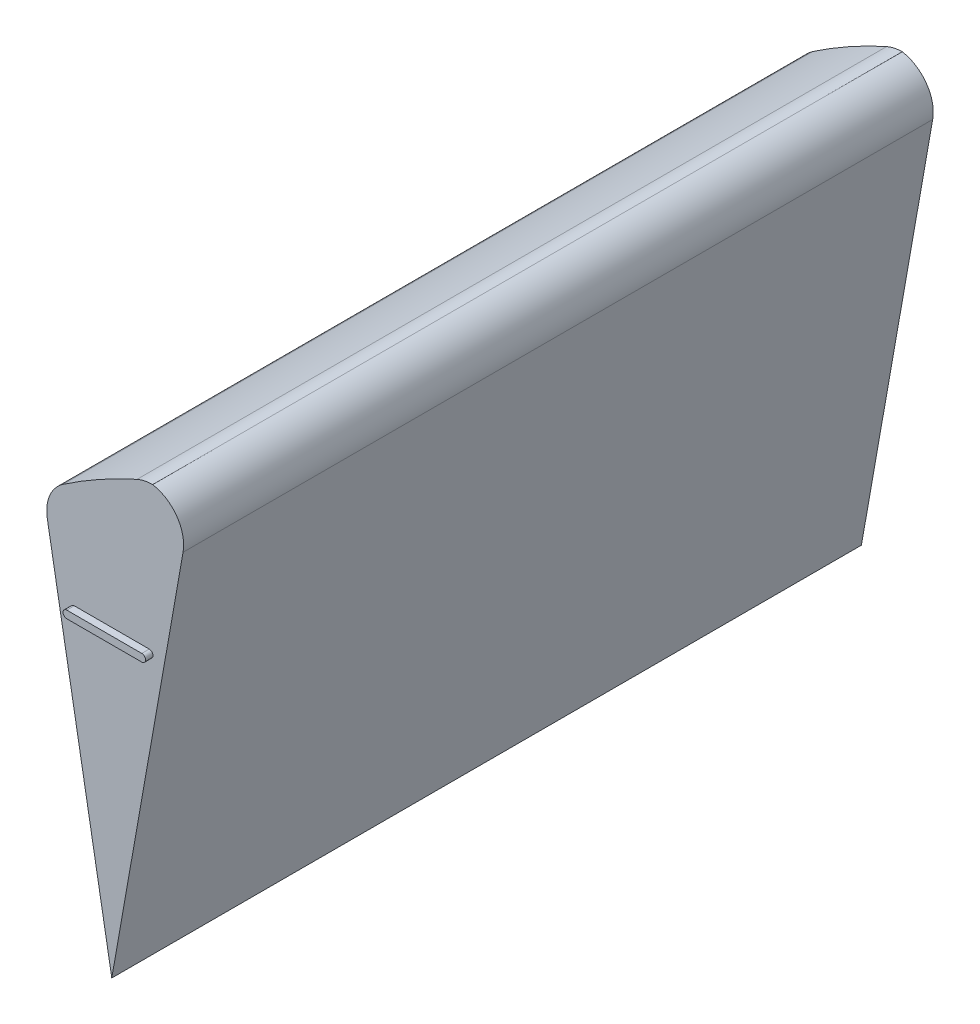
ISO-10303-21;
HEADER;
FILE_DESCRIPTION(('STEP AP214'),'2;1');
FILE_NAME('part.step','',(''),(''),'','','');
FILE_SCHEMA(('AUTOMOTIVE_DESIGN { 1 0 10303 214 1 1 1 1 }'));
ENDSEC;
DATA;
#1=APPLICATION_CONTEXT('core data for automotive mechanical design processes');
#2=APPLICATION_PROTOCOL_DEFINITION('international standard','automotive_design',2000,#1);
#3=PRODUCT_CONTEXT('',#1,'mechanical');
#4=PRODUCT('Part','Part','',(#3));
#5=PRODUCT_RELATED_PRODUCT_CATEGORY('part','',(#4));
#6=PRODUCT_DEFINITION_FORMATION('','',#4);
#7=PRODUCT_DEFINITION_CONTEXT('part definition',#1,'design');
#8=PRODUCT_DEFINITION('design','',#6,#7);
#9=PRODUCT_DEFINITION_SHAPE('','',#8);
#10=(LENGTH_UNIT() NAMED_UNIT(*) SI_UNIT(.MILLI.,.METRE.));
#11=(NAMED_UNIT(*) PLANE_ANGLE_UNIT() SI_UNIT($,.RADIAN.));
#12=(NAMED_UNIT(*) SI_UNIT($,.STERADIAN.) SOLID_ANGLE_UNIT());
#13=UNCERTAINTY_MEASURE_WITH_UNIT(LENGTH_MEASURE(1.E-05),#10,'distance_accuracy_value','');
#14=(GEOMETRIC_REPRESENTATION_CONTEXT(3) GLOBAL_UNCERTAINTY_ASSIGNED_CONTEXT((#13)) GLOBAL_UNIT_ASSIGNED_CONTEXT((#10,
#11,#12)) REPRESENTATION_CONTEXT('',''));
#15=CARTESIAN_POINT('',(0.,0.,0.));
#16=DIRECTION('',(0.,0.,1.));
#17=DIRECTION('',(1.,0.,0.));
#18=AXIS2_PLACEMENT_3D('',#15,#16,#17);
#19=CARTESIAN_POINT('',(0.,0.,100.));
#20=DIRECTION('',(0.,0.,1.));
#21=DIRECTION('',(1.,0.,0.));
#22=AXIS2_PLACEMENT_3D('',#19,#20,#21);
#23=PLANE('',#22);
#24=DIRECTION('',(0.173648177666931,0.98480775301221,0.));
#25=VECTOR('',#24,1.);
#26=CARTESIAN_POINT('',(0.,0.,100.));
#27=LINE('',#26,#25);
#28=CARTESIAN_POINT('',(0.,0.,100.));
#29=VERTEX_POINT('',#28);
#30=CARTESIAN_POINT('',(9.51110239778432,53.9401421130764,100.));
#31=VERTEX_POINT('',#30);
#32=EDGE_CURVE('E156',#29,#31,#27,.T.);
#33=ORIENTED_EDGE('',*,*,#32,.T.);
#34=CARTESIAN_POINT('',(4.58706363272326,54.808383001411,100.));
#35=DIRECTION('',(0.,0.,1.));
#36=DIRECTION('',(1.,0.,0.));
#37=AXIS2_PLACEMENT_3D('',#34,#35,#36);
#38=CIRCLE('',#37,5.);
#39=CARTESIAN_POINT('',(5.45501259305816,59.7324732323322,100.));
#40=VERTEX_POINT('',#39);
#41=EDGE_CURVE('E63',#31,#40,#38,.T.);
#42=ORIENTED_EDGE('',*,*,#41,.T.);
#43=CARTESIAN_POINT('',(5.41666666666665,54.7326202755015,100.));
#44=DIRECTION('',(0.,0.,1.));
#45=DIRECTION('',(1.,0.,0.));
#46=AXIS2_PLACEMENT_3D('',#43,#44,#45);
#47=CIRCLE('',#46,5.);
#48=CARTESIAN_POINT('',(3.36805555555555,59.2936719651266,100.));
#49=VERTEX_POINT('',#48);
#50=EDGE_CURVE('E176',#40,#49,#47,.T.);
#51=ORIENTED_EDGE('',*,*,#50,.T.);
#52=CARTESIAN_POINT('',(30.0000000000001,0.,100.));
#53=DIRECTION('',(0.,0.,1.));
#54=DIRECTION('',(1.,0.,0.));
#55=AXIS2_PLACEMENT_3D('',#52,#53,#54);
#56=CIRCLE('',#55,65.);
#57=CARTESIAN_POINT('',(-6.48516847219564,53.7943536215049,100.));
#58=VERTEX_POINT('',#57);
#59=EDGE_CURVE('E147',#49,#58,#56,.T.);
#60=ORIENTED_EDGE('',*,*,#59,.T.);
#61=CARTESIAN_POINT('',(-3.67861705125755,49.6563264198507,100.));
#62=DIRECTION('',(0.,0.,1.));
#63=DIRECTION('',(1.,0.,0.));
#64=AXIS2_PLACEMENT_3D('',#61,#62,#63);
#65=CIRCLE('',#64,5.);
#66=CARTESIAN_POINT('',(-8.60265581631857,48.788085531516,100.));
#67=VERTEX_POINT('',#66);
#68=EDGE_CURVE('E174',#58,#67,#65,.T.);
#69=ORIENTED_EDGE('',*,*,#68,.T.);
#70=DIRECTION('',(-0.173648177666931,0.98480775301221,0.));
#71=VECTOR('',#70,1.);
#72=CARTESIAN_POINT('',(0.,0.,100.));
#73=LINE('',#72,#71);
#74=EDGE_CURVE('E153',#29,#67,#73,.T.);
#75=ORIENTED_EDGE('',*,*,#74,.F.);
#76=EDGE_LOOP('',(#33,#42,#51,#60,#69,#75));
#77=FACE_BOUND('',#76,.T.);
#78=DIRECTION('',(1.,0.,0.));
#79=VECTOR('',#78,1.);
#80=CARTESIAN_POINT('',(-5.,39.5000000000001,100.));
#81=LINE('',#80,#79);
#82=CARTESIAN_POINT('',(-5.,39.5000000000001,100.));
#83=VERTEX_POINT('',#82);
#84=CARTESIAN_POINT('',(4.99999999999999,39.5000000000001,100.));
#85=VERTEX_POINT('',#84);
#86=EDGE_CURVE('E213',#83,#85,#81,.T.);
#87=ORIENTED_EDGE('',*,*,#86,.F.);
#88=CARTESIAN_POINT('',(-5.00000000000002,40.0000000000001,100.));
#89=DIRECTION('',(0.,0.,1.));
#90=DIRECTION('',(1.,0.,0.));
#91=AXIS2_PLACEMENT_3D('',#88,#89,#90);
#92=CIRCLE('',#91,0.5);
#93=CARTESIAN_POINT('',(-4.99999999999998,40.5000000000001,100.));
#94=VERTEX_POINT('',#93);
#95=EDGE_CURVE('E139',#94,#83,#92,.T.);
#96=ORIENTED_EDGE('',*,*,#95,.F.);
#97=DIRECTION('',(-1.,0.,0.));
#98=VECTOR('',#97,1.);
#99=CARTESIAN_POINT('',(-4.99999999999998,40.5000000000001,100.));
#100=LINE('',#99,#98);
#101=CARTESIAN_POINT('',(5.00000000000002,40.5000000000001,100.));
#102=VERTEX_POINT('',#101);
#103=EDGE_CURVE('E135',#102,#94,#100,.T.);
#104=ORIENTED_EDGE('',*,*,#103,.F.);
#105=CARTESIAN_POINT('',(5.,40.0000000000001,100.));
#106=DIRECTION('',(0.,0.,1.));
#107=DIRECTION('',(1.,0.,0.));
#108=AXIS2_PLACEMENT_3D('',#105,#106,#107);
#109=CIRCLE('',#108,0.5);
#110=EDGE_CURVE('E215',#85,#102,#109,.T.);
#111=ORIENTED_EDGE('',*,*,#110,.F.);
#112=EDGE_LOOP('',(#87,#96,#104,#111));
#113=FACE_BOUND('',#112,.T.);
#114=ADVANCED_FACE('F39',(#77,#113),#23,.T.);
#115=CARTESIAN_POINT('',(0.,0.,0.));
#116=DIRECTION('',(0.,0.,1.));
#117=DIRECTION('',(1.,0.,0.));
#118=AXIS2_PLACEMENT_3D('',#115,#116,#117);
#119=PLANE('',#118);
#120=CARTESIAN_POINT('',(0.,42.5000000000001,0.));
#121=DIRECTION('',(0.,0.,1.));
#122=DIRECTION('',(1.,0.,0.));
#123=AXIS2_PLACEMENT_3D('',#120,#121,#122);
#124=CIRCLE('',#123,2.);
#125=CARTESIAN_POINT('',(2.00000000000002,42.5000000000001,0.));
#126=VERTEX_POINT('',#125);
#127=EDGE_CURVE('E226',#126,#126,#124,.T.);
#128=ORIENTED_EDGE('',*,*,#127,.T.);
#129=EDGE_LOOP('',(#128));
#130=FACE_BOUND('',#129,.T.);
#131=CARTESIAN_POINT('',(5.41666666666665,54.7326202755015,0.));
#132=DIRECTION('',(0.,0.,1.));
#133=DIRECTION('',(1.,0.,0.));
#134=AXIS2_PLACEMENT_3D('',#131,#132,#133);
#135=CIRCLE('',#134,5.);
#136=CARTESIAN_POINT('',(3.36805555555555,59.2936719651266,0.));
#137=VERTEX_POINT('',#136);
#138=CARTESIAN_POINT('',(5.45501259305816,59.7324732323322,0.));
#139=VERTEX_POINT('',#138);
#140=EDGE_CURVE('E167',#137,#139,#135,.F.);
#141=ORIENTED_EDGE('',*,*,#140,.T.);
#142=CARTESIAN_POINT('',(4.58706363272326,54.808383001411,0.));
#143=DIRECTION('',(0.,0.,1.));
#144=DIRECTION('',(1.,0.,0.));
#145=AXIS2_PLACEMENT_3D('',#142,#143,#144);
#146=CIRCLE('',#145,5.);
#147=CARTESIAN_POINT('',(9.51110239778432,53.9401421130764,0.));
#148=VERTEX_POINT('',#147);
#149=EDGE_CURVE('E169',#139,#148,#146,.F.);
#150=ORIENTED_EDGE('',*,*,#149,.T.);
#151=DIRECTION('',(0.173648177666931,0.98480775301221,0.));
#152=VECTOR('',#151,1.);
#153=CARTESIAN_POINT('',(0.,0.,0.));
#154=LINE('',#153,#152);
#155=CARTESIAN_POINT('',(0.,0.,0.));
#156=VERTEX_POINT('',#155);
#157=EDGE_CURVE('E157',#156,#148,#154,.T.);
#158=ORIENTED_EDGE('',*,*,#157,.F.);
#159=DIRECTION('',(-0.173648177666931,0.98480775301221,0.));
#160=VECTOR('',#159,1.);
#161=CARTESIAN_POINT('',(0.,0.,0.));
#162=LINE('',#161,#160);
#163=CARTESIAN_POINT('',(-8.60265581631857,48.788085531516,0.));
#164=VERTEX_POINT('',#163);
#165=EDGE_CURVE('E150',#156,#164,#162,.T.);
#166=ORIENTED_EDGE('',*,*,#165,.T.);
#167=CARTESIAN_POINT('',(-3.67861705125755,49.6563264198507,0.));
#168=DIRECTION('',(0.,0.,1.));
#169=DIRECTION('',(1.,0.,0.));
#170=AXIS2_PLACEMENT_3D('',#167,#168,#169);
#171=CIRCLE('',#170,5.);
#172=CARTESIAN_POINT('',(-6.48516847219564,53.7943536215049,0.));
#173=VERTEX_POINT('',#172);
#174=EDGE_CURVE('E165',#164,#173,#171,.F.);
#175=ORIENTED_EDGE('',*,*,#174,.T.);
#176=CARTESIAN_POINT('',(30.0000000000001,0.,0.));
#177=DIRECTION('',(0.,0.,1.));
#178=DIRECTION('',(1.,0.,0.));
#179=AXIS2_PLACEMENT_3D('',#176,#177,#178);
#180=CIRCLE('',#179,65.);
#181=EDGE_CURVE('E143',#137,#173,#180,.T.);
#182=ORIENTED_EDGE('',*,*,#181,.F.);
#183=EDGE_LOOP('',(#141,#150,#158,#166,#175,#182));
#184=FACE_BOUND('',#183,.T.);
#185=ADVANCED_FACE('F191',(#130,#184),#119,.F.);
#186=CARTESIAN_POINT('',(0.,0.,100.));
#187=DIRECTION('',(-0.98480775301221,-0.173648177666931,0.));
#188=DIRECTION('',(0.173648177666931,-0.98480775301221,0.));
#189=AXIS2_PLACEMENT_3D('',#186,#187,#188);
#190=PLANE('',#189);
#191=ORIENTED_EDGE('',*,*,#74,.T.);
#192=DIRECTION('',(0.,0.,1.));
#193=VECTOR('',#192,1.);
#194=CARTESIAN_POINT('',(-8.60265581631857,48.788085531516,0.));
#195=LINE('',#194,#193);
#196=EDGE_CURVE('E12',#67,#164,#195,.F.);
#197=ORIENTED_EDGE('',*,*,#196,.T.);
#198=ORIENTED_EDGE('',*,*,#165,.F.);
#199=DIRECTION('',(0.,0.,-1.));
#200=VECTOR('',#199,1.);
#201=CARTESIAN_POINT('',(0.,0.,100.));
#202=LINE('',#201,#200);
#203=EDGE_CURVE('E159',#29,#156,#202,.T.);
#204=ORIENTED_EDGE('',*,*,#203,.F.);
#205=EDGE_LOOP('',(#191,#197,#198,#204));
#206=FACE_BOUND('',#205,.T.);
#207=ADVANCED_FACE('F206',(#206),#190,.T.);
#208=CARTESIAN_POINT('',(0.,0.,100.));
#209=DIRECTION('',(-0.98480775301221,0.173648177666931,0.));
#210=DIRECTION('',(-0.173648177666931,-0.98480775301221,0.));
#211=AXIS2_PLACEMENT_3D('',#208,#209,#210);
#212=PLANE('',#211);
#213=ORIENTED_EDGE('',*,*,#157,.T.);
#214=DIRECTION('',(0.,0.,-1.));
#215=VECTOR('',#214,1.);
#216=CARTESIAN_POINT('',(9.51110239778433,53.9401421130764,100.));
#217=LINE('',#216,#215);
#218=EDGE_CURVE('E171',#148,#31,#217,.F.);
#219=ORIENTED_EDGE('',*,*,#218,.T.);
#220=ORIENTED_EDGE('',*,*,#32,.F.);
#221=ORIENTED_EDGE('',*,*,#203,.T.);
#222=EDGE_LOOP('',(#213,#219,#220,#221));
#223=FACE_BOUND('',#222,.T.);
#224=ADVANCED_FACE('F202',(#223),#212,.F.);
#225=CARTESIAN_POINT('',(30.0000000000001,0.,100.));
#226=DIRECTION('',(0.,0.,-1.));
#227=DIRECTION('',(-1.,0.,0.));
#228=AXIS2_PLACEMENT_3D('',#225,#226,#227);
#229=CYLINDRICAL_SURFACE('',#228,65.);
#230=ORIENTED_EDGE('',*,*,#59,.F.);
#231=DIRECTION('',(0.,0.,-1.));
#232=VECTOR('',#231,1.);
#233=CARTESIAN_POINT('',(3.36805555555555,59.2936719651266,100.));
#234=LINE('',#233,#232);
#235=EDGE_CURVE('E48',#49,#137,#234,.T.);
#236=ORIENTED_EDGE('',*,*,#235,.T.);
#237=ORIENTED_EDGE('',*,*,#181,.T.);
#238=DIRECTION('',(0.,0.,-1.));
#239=VECTOR('',#238,1.);
#240=CARTESIAN_POINT('',(-6.48516847219566,53.7943536215049,100.));
#241=LINE('',#240,#239);
#242=EDGE_CURVE('E179',#173,#58,#241,.F.);
#243=ORIENTED_EDGE('',*,*,#242,.T.);
#244=EDGE_LOOP('',(#230,#236,#237,#243));
#245=FACE_BOUND('',#244,.T.);
#246=ADVANCED_FACE('F186',(#245),#229,.T.);
#247=CARTESIAN_POINT('',(5.41666666666665,54.7326202755015,100.));
#248=DIRECTION('',(0.,0.,1.));
#249=DIRECTION('',(1.,0.,0.));
#250=AXIS2_PLACEMENT_3D('',#247,#248,#249);
#251=CYLINDRICAL_SURFACE('',#250,5.);
#252=ORIENTED_EDGE('',*,*,#235,.F.);
#253=ORIENTED_EDGE('',*,*,#50,.F.);
#254=DIRECTION('',(0.,0.,1.));
#255=VECTOR('',#254,1.);
#256=CARTESIAN_POINT('',(5.45501259305816,59.7324732323322,50.));
#257=LINE('',#256,#255);
#258=EDGE_CURVE('E43',#139,#40,#257,.T.);
#259=ORIENTED_EDGE('',*,*,#258,.F.);
#260=ORIENTED_EDGE('',*,*,#140,.F.);
#261=EDGE_LOOP('',(#252,#253,#259,#260));
#262=FACE_BOUND('',#261,.T.);
#263=ADVANCED_FACE('F194',(#262),#251,.T.);
#264=CARTESIAN_POINT('',(4.58706363272326,54.808383001411,100.));
#265=DIRECTION('',(0.,0.,-1.));
#266=DIRECTION('',(-1.,0.,0.));
#267=AXIS2_PLACEMENT_3D('',#264,#265,#266);
#268=CYLINDRICAL_SURFACE('',#267,5.);
#269=ORIENTED_EDGE('',*,*,#41,.F.);
#270=ORIENTED_EDGE('',*,*,#218,.F.);
#271=ORIENTED_EDGE('',*,*,#149,.F.);
#272=ORIENTED_EDGE('',*,*,#258,.T.);
#273=EDGE_LOOP('',(#269,#270,#271,#272));
#274=FACE_BOUND('',#273,.T.);
#275=ADVANCED_FACE('F198',(#274),#268,.T.);
#276=CARTESIAN_POINT('',(-3.67861705125755,49.6563264198507,100.));
#277=DIRECTION('',(0.,0.,-1.));
#278=DIRECTION('',(-1.,0.,0.));
#279=AXIS2_PLACEMENT_3D('',#276,#277,#278);
#280=CYLINDRICAL_SURFACE('',#279,5.);
#281=ORIENTED_EDGE('',*,*,#174,.F.);
#282=ORIENTED_EDGE('',*,*,#196,.F.);
#283=ORIENTED_EDGE('',*,*,#68,.F.);
#284=ORIENTED_EDGE('',*,*,#242,.F.);
#285=EDGE_LOOP('',(#281,#282,#283,#284));
#286=FACE_BOUND('',#285,.T.);
#287=ADVANCED_FACE('F41',(#286),#280,.T.);
#288=CARTESIAN_POINT('',(-5.00000000000002,40.0000000000001,101.));
#289=DIRECTION('',(0.,0.,-1.));
#290=DIRECTION('',(-1.,0.,0.));
#291=AXIS2_PLACEMENT_3D('',#288,#289,#290);
#292=CYLINDRICAL_SURFACE('',#291,0.5);
#293=ORIENTED_EDGE('',*,*,#95,.T.);
#294=DIRECTION('',(0.,0.,-1.));
#295=VECTOR('',#294,1.);
#296=CARTESIAN_POINT('',(-5.,39.5000000000001,101.));
#297=LINE('',#296,#295);
#298=CARTESIAN_POINT('',(-5.,39.5000000000001,101.));
#299=VERTEX_POINT('',#298);
#300=EDGE_CURVE('E120',#299,#83,#297,.T.);
#301=ORIENTED_EDGE('',*,*,#300,.F.);
#302=CARTESIAN_POINT('',(-5.00000000000002,40.0000000000001,101.));
#303=DIRECTION('',(0.,0.,1.));
#304=DIRECTION('',(1.,0.,0.));
#305=AXIS2_PLACEMENT_3D('',#302,#303,#304);
#306=CIRCLE('',#305,0.5);
#307=CARTESIAN_POINT('',(-4.99999999999998,40.5000000000001,101.));
#308=VERTEX_POINT('',#307);
#309=EDGE_CURVE('E127',#308,#299,#306,.T.);
#310=ORIENTED_EDGE('',*,*,#309,.F.);
#311=DIRECTION('',(0.,0.,-1.));
#312=VECTOR('',#311,1.);
#313=CARTESIAN_POINT('',(-4.99999999999998,40.5000000000001,101.));
#314=LINE('',#313,#312);
#315=EDGE_CURVE('E223',#308,#94,#314,.T.);
#316=ORIENTED_EDGE('',*,*,#315,.T.);
#317=EDGE_LOOP('',(#293,#301,#310,#316));
#318=FACE_BOUND('',#317,.T.);
#319=ADVANCED_FACE('F137',(#318),#292,.T.);
#320=CARTESIAN_POINT('',(-5.,39.5000000000001,101.));
#321=DIRECTION('',(0.,1.,0.));
#322=DIRECTION('',(0.,0.,1.));
#323=AXIS2_PLACEMENT_3D('',#320,#321,#322);
#324=PLANE('',#323);
#325=ORIENTED_EDGE('',*,*,#86,.T.);
#326=DIRECTION('',(0.,0.,-1.));
#327=VECTOR('',#326,1.);
#328=CARTESIAN_POINT('',(4.99999999999999,39.5000000000001,101.));
#329=LINE('',#328,#327);
#330=CARTESIAN_POINT('',(4.99999999999999,39.5000000000001,101.));
#331=VERTEX_POINT('',#330);
#332=EDGE_CURVE('E123',#331,#85,#329,.T.);
#333=ORIENTED_EDGE('',*,*,#332,.F.);
#334=DIRECTION('',(1.,0.,0.));
#335=VECTOR('',#334,1.);
#336=CARTESIAN_POINT('',(-5.,39.5000000000001,101.));
#337=LINE('',#336,#335);
#338=EDGE_CURVE('E116',#299,#331,#337,.T.);
#339=ORIENTED_EDGE('',*,*,#338,.F.);
#340=ORIENTED_EDGE('',*,*,#300,.T.);
#341=EDGE_LOOP('',(#325,#333,#339,#340));
#342=FACE_BOUND('',#341,.T.);
#343=ADVANCED_FACE('F118',(#342),#324,.F.);
#344=CARTESIAN_POINT('',(5.,40.0000000000001,101.));
#345=DIRECTION('',(0.,0.,-1.));
#346=DIRECTION('',(-1.,0.,0.));
#347=AXIS2_PLACEMENT_3D('',#344,#345,#346);
#348=CYLINDRICAL_SURFACE('',#347,0.5);
#349=ORIENTED_EDGE('',*,*,#110,.T.);
#350=DIRECTION('',(0.,0.,-1.));
#351=VECTOR('',#350,1.);
#352=CARTESIAN_POINT('',(5.00000000000002,40.5000000000001,101.));
#353=LINE('',#352,#351);
#354=CARTESIAN_POINT('',(5.00000000000002,40.5000000000001,101.));
#355=VERTEX_POINT('',#354);
#356=EDGE_CURVE('E55',#355,#102,#353,.T.);
#357=ORIENTED_EDGE('',*,*,#356,.F.);
#358=CARTESIAN_POINT('',(5.,40.0000000000001,101.));
#359=DIRECTION('',(0.,0.,1.));
#360=DIRECTION('',(1.,0.,0.));
#361=AXIS2_PLACEMENT_3D('',#358,#359,#360);
#362=CIRCLE('',#361,0.5);
#363=EDGE_CURVE('E126',#331,#355,#362,.T.);
#364=ORIENTED_EDGE('',*,*,#363,.F.);
#365=ORIENTED_EDGE('',*,*,#332,.T.);
#366=EDGE_LOOP('',(#349,#357,#364,#365));
#367=FACE_BOUND('',#366,.T.);
#368=ADVANCED_FACE('F248',(#367),#348,.T.);
#369=CARTESIAN_POINT('',(-4.99999999999998,40.5000000000001,101.));
#370=DIRECTION('',(0.,-1.,0.));
#371=DIRECTION('',(0.,0.,-1.));
#372=AXIS2_PLACEMENT_3D('',#369,#370,#371);
#373=PLANE('',#372);
#374=ORIENTED_EDGE('',*,*,#103,.T.);
#375=ORIENTED_EDGE('',*,*,#315,.F.);
#376=DIRECTION('',(-1.,0.,0.));
#377=VECTOR('',#376,1.);
#378=CARTESIAN_POINT('',(-4.99999999999998,40.5000000000001,101.));
#379=LINE('',#378,#377);
#380=EDGE_CURVE('E131',#355,#308,#379,.T.);
#381=ORIENTED_EDGE('',*,*,#380,.F.);
#382=ORIENTED_EDGE('',*,*,#356,.T.);
#383=EDGE_LOOP('',(#374,#375,#381,#382));
#384=FACE_BOUND('',#383,.T.);
#385=ADVANCED_FACE('F245',(#384),#373,.F.);
#386=CARTESIAN_POINT('',(-5.00000000000002,40.0000000000001,101.));
#387=DIRECTION('',(0.,0.,1.));
#388=DIRECTION('',(1.,0.,0.));
#389=AXIS2_PLACEMENT_3D('',#386,#387,#388);
#390=PLANE('',#389);
#391=ORIENTED_EDGE('',*,*,#309,.T.);
#392=ORIENTED_EDGE('',*,*,#338,.T.);
#393=ORIENTED_EDGE('',*,*,#363,.T.);
#394=ORIENTED_EDGE('',*,*,#380,.T.);
#395=EDGE_LOOP('',(#391,#392,#393,#394));
#396=FACE_BOUND('',#395,.T.);
#397=ADVANCED_FACE('F130',(#396),#390,.T.);
#398=CARTESIAN_POINT('',(0.,42.5000000000001,2.));
#399=DIRECTION('',(0.,0.,-1.));
#400=DIRECTION('',(-1.,0.,0.));
#401=AXIS2_PLACEMENT_3D('',#398,#399,#400);
#402=CYLINDRICAL_SURFACE('',#401,2.);
#403=CARTESIAN_POINT('',(0.,42.5000000000001,2.));
#404=DIRECTION('',(0.,0.,1.));
#405=DIRECTION('',(1.,0.,0.));
#406=AXIS2_PLACEMENT_3D('',#403,#404,#405);
#407=CIRCLE('',#406,2.);
#408=CARTESIAN_POINT('',(2.00000000000002,42.5000000000001,2.));
#409=VERTEX_POINT('',#408);
#410=EDGE_CURVE('E218',#409,#409,#407,.T.);
#411=ORIENTED_EDGE('',*,*,#410,.T.);
#412=EDGE_LOOP('',(#411));
#413=FACE_BOUND('',#412,.T.);
#414=ORIENTED_EDGE('',*,*,#127,.F.);
#415=EDGE_LOOP('',(#414));
#416=FACE_BOUND('',#415,.T.);
#417=ADVANCED_FACE('F232',(#413,#416),#402,.F.);
#418=CARTESIAN_POINT('',(0.,42.5000000000001,2.));
#419=DIRECTION('',(0.,0.,1.));
#420=DIRECTION('',(1.,0.,0.));
#421=AXIS2_PLACEMENT_3D('',#418,#419,#420);
#422=PLANE('',#421);
#423=ORIENTED_EDGE('',*,*,#410,.F.);
#424=EDGE_LOOP('',(#423));
#425=FACE_BOUND('',#424,.T.);
#426=ADVANCED_FACE('F235',(#425),#422,.F.);
#427=CLOSED_SHELL('',(#114,#185,#207,#224,#246,#263,#275,#287,#319,#343,#368,#385,#397,#417,#426));
#428=MANIFOLD_SOLID_BREP('B2',#427);
#429=ADVANCED_BREP_SHAPE_REPRESENTATION('',(#18,#428),#14);
#430=SHAPE_DEFINITION_REPRESENTATION(#9,#429);
ENDSEC;
END-ISO-10303-21;
